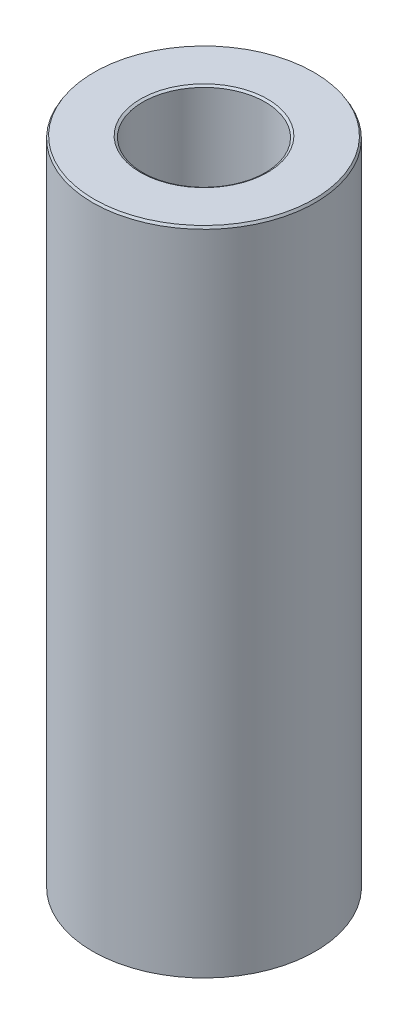
ISO-10303-21;
HEADER;
FILE_DESCRIPTION(('STEP AP214'),'2;1');
FILE_NAME('part.step','',(''),(''),'','','');
FILE_SCHEMA(('AUTOMOTIVE_DESIGN { 1 0 10303 214 1 1 1 1 }'));
ENDSEC;
DATA;
#1=APPLICATION_CONTEXT('core data for automotive mechanical design processes');
#2=APPLICATION_PROTOCOL_DEFINITION('international standard','automotive_design',2000,#1);
#3=PRODUCT_CONTEXT('',#1,'mechanical');
#4=PRODUCT('Part','Part','',(#3));
#5=PRODUCT_RELATED_PRODUCT_CATEGORY('part','',(#4));
#6=PRODUCT_DEFINITION_FORMATION('','',#4);
#7=PRODUCT_DEFINITION_CONTEXT('part definition',#1,'design');
#8=PRODUCT_DEFINITION('design','',#6,#7);
#9=PRODUCT_DEFINITION_SHAPE('','',#8);
#10=(LENGTH_UNIT() NAMED_UNIT(*) SI_UNIT(.MILLI.,.METRE.));
#11=(NAMED_UNIT(*) PLANE_ANGLE_UNIT() SI_UNIT($,.RADIAN.));
#12=(NAMED_UNIT(*) SI_UNIT($,.STERADIAN.) SOLID_ANGLE_UNIT());
#13=UNCERTAINTY_MEASURE_WITH_UNIT(LENGTH_MEASURE(1.E-05),#10,'distance_accuracy_value','');
#14=(GEOMETRIC_REPRESENTATION_CONTEXT(3) GLOBAL_UNCERTAINTY_ASSIGNED_CONTEXT((#13)) GLOBAL_UNIT_ASSIGNED_CONTEXT((#10,
#11,#12)) REPRESENTATION_CONTEXT('',''));
#15=CARTESIAN_POINT('',(0.,0.,0.));
#16=DIRECTION('',(0.,0.,1.));
#17=DIRECTION('',(1.,0.,0.));
#18=AXIS2_PLACEMENT_3D('',#15,#16,#17);
#19=CARTESIAN_POINT('',(0.,175.694921431091,0.));
#20=DIRECTION('',(0.,-1.,0.));
#21=DIRECTION('',(0.,0.,-1.));
#22=AXIS2_PLACEMENT_3D('',#19,#20,#21);
#23=CYLINDRICAL_SURFACE('',#22,30.);
#24=CARTESIAN_POINT('',(0.,0.384070202301856,0.));
#25=DIRECTION('',(0.,1.,0.));
#26=DIRECTION('',(0.,0.,1.));
#27=AXIS2_PLACEMENT_3D('',#24,#25,#26);
#28=CIRCLE('',#27,30.);
#29=CARTESIAN_POINT('',(0.,0.384070202301856,30.));
#30=VERTEX_POINT('',#29);
#31=EDGE_CURVE('E10',#30,#30,#28,.T.);
#32=ORIENTED_EDGE('',*,*,#31,.T.);
#33=EDGE_LOOP('',(#32));
#34=FACE_BOUND('',#33,.T.);
#35=CARTESIAN_POINT('',(0.,175.063537443208,0.));
#36=DIRECTION('',(0.,1.,0.));
#37=DIRECTION('',(0.,0.,1.));
#38=AXIS2_PLACEMENT_3D('',#35,#36,#37);
#39=CIRCLE('',#38,30.);
#40=CARTESIAN_POINT('',(0.,175.063537443208,30.));
#41=VERTEX_POINT('',#40);
#42=EDGE_CURVE('E50',#41,#41,#39,.F.);
#43=ORIENTED_EDGE('',*,*,#42,.T.);
#44=EDGE_LOOP('',(#43));
#45=FACE_BOUND('',#44,.T.);
#46=ADVANCED_FACE('F39',(#34,#45),#23,.T.);
#47=CARTESIAN_POINT('',(0.,175.694921431091,0.));
#48=DIRECTION('',(0.,1.,0.));
#49=DIRECTION('',(0.,0.,1.));
#50=AXIS2_PLACEMENT_3D('',#47,#48,#49);
#51=PLANE('',#50);
#52=CARTESIAN_POINT('',(0.,175.694921431091,0.));
#53=DIRECTION('',(0.,1.,0.));
#54=DIRECTION('',(0.,0.,1.));
#55=AXIS2_PLACEMENT_3D('',#52,#53,#54);
#56=CIRCLE('',#55,17.1297919131304);
#57=CARTESIAN_POINT('',(0.,175.694921431091,17.1297919131304));
#58=VERTEX_POINT('',#57);
#59=EDGE_CURVE('E58',#58,#58,#56,.F.);
#60=ORIENTED_EDGE('',*,*,#59,.T.);
#61=EDGE_LOOP('',(#60));
#62=FACE_BOUND('',#61,.T.);
#63=CARTESIAN_POINT('',(0.,175.694921431091,0.));
#64=DIRECTION('',(0.,1.,0.));
#65=DIRECTION('',(0.,0.,1.));
#66=AXIS2_PLACEMENT_3D('',#63,#64,#65);
#67=CIRCLE('',#66,29.6159297976981);
#68=CARTESIAN_POINT('',(0.,175.694921431091,29.6159297976981));
#69=VERTEX_POINT('',#68);
#70=EDGE_CURVE('E61',#69,#69,#67,.T.);
#71=ORIENTED_EDGE('',*,*,#70,.T.);
#72=EDGE_LOOP('',(#71));
#73=FACE_BOUND('',#72,.T.);
#74=ADVANCED_FACE('F88',(#62,#73),#51,.T.);
#75=CARTESIAN_POINT('',(0.,0.,0.));
#76=DIRECTION('',(0.,1.,0.));
#77=DIRECTION('',(0.,0.,1.));
#78=AXIS2_PLACEMENT_3D('',#75,#76,#77);
#79=PLANE('',#78);
#80=CARTESIAN_POINT('',(0.,0.,0.));
#81=DIRECTION('',(0.,1.,0.));
#82=DIRECTION('',(0.,0.,1.));
#83=AXIS2_PLACEMENT_3D('',#80,#81,#82);
#84=CIRCLE('',#83,16.8824781275501);
#85=CARTESIAN_POINT('',(0.,0.,16.8824781275501));
#86=VERTEX_POINT('',#85);
#87=EDGE_CURVE('E51',#86,#86,#84,.T.);
#88=ORIENTED_EDGE('',*,*,#87,.T.);
#89=EDGE_LOOP('',(#88));
#90=FACE_BOUND('',#89,.T.);
#91=CARTESIAN_POINT('',(0.,0.,0.));
#92=DIRECTION('',(0.,1.,0.));
#93=DIRECTION('',(0.,0.,1.));
#94=AXIS2_PLACEMENT_3D('',#91,#92,#93);
#95=CIRCLE('',#94,29.3686160121178);
#96=CARTESIAN_POINT('',(0.,0.,29.3686160121178));
#97=VERTEX_POINT('',#96);
#98=EDGE_CURVE('E54',#97,#97,#95,.F.);
#99=ORIENTED_EDGE('',*,*,#98,.T.);
#100=EDGE_LOOP('',(#99));
#101=FACE_BOUND('',#100,.T.);
#102=ADVANCED_FACE('F83',(#90,#101),#79,.F.);
#103=CARTESIAN_POINT('',(0.,175.694921431091,0.));
#104=DIRECTION('',(0.,-1.,0.));
#105=DIRECTION('',(0.,0.,-1.));
#106=AXIS2_PLACEMENT_3D('',#103,#104,#105);
#107=CYLINDRICAL_SURFACE('',#106,16.4984079252482);
#108=CARTESIAN_POINT('',(0.,175.310851228789,0.));
#109=DIRECTION('',(0.,1.,0.));
#110=DIRECTION('',(0.,0.,1.));
#111=AXIS2_PLACEMENT_3D('',#108,#109,#110);
#112=CIRCLE('',#111,16.4984079252482);
#113=CARTESIAN_POINT('',(0.,175.310851228789,16.4984079252482));
#114=VERTEX_POINT('',#113);
#115=EDGE_CURVE('E67',#114,#114,#112,.T.);
#116=ORIENTED_EDGE('',*,*,#115,.T.);
#117=EDGE_LOOP('',(#116));
#118=FACE_BOUND('',#117,.T.);
#119=CARTESIAN_POINT('',(0.,0.631383987882234,0.));
#120=DIRECTION('',(0.,1.,0.));
#121=DIRECTION('',(0.,0.,1.));
#122=AXIS2_PLACEMENT_3D('',#119,#120,#121);
#123=CIRCLE('',#122,16.4984079252482);
#124=CARTESIAN_POINT('',(0.,0.631383987882234,16.4984079252482));
#125=VERTEX_POINT('',#124);
#126=EDGE_CURVE('E69',#125,#125,#123,.F.);
#127=ORIENTED_EDGE('',*,*,#126,.T.);
#128=EDGE_LOOP('',(#127));
#129=FACE_BOUND('',#128,.T.);
#130=ADVANCED_FACE('F71',(#118,#129),#107,.F.);
#131=CARTESIAN_POINT('',(0.,175.310851228789,0.));
#132=DIRECTION('',(0.,1.,0.));
#133=DIRECTION('',(0.,0.,1.));
#134=AXIS2_PLACEMENT_3D('',#131,#132,#133);
#135=CONICAL_SURFACE('',#134,16.4984079252482,1.02429700954694);
#136=ORIENTED_EDGE('',*,*,#59,.F.);
#137=EDGE_LOOP('',(#136));
#138=FACE_BOUND('',#137,.T.);
#139=ORIENTED_EDGE('',*,*,#115,.F.);
#140=EDGE_LOOP('',(#139));
#141=FACE_BOUND('',#140,.T.);
#142=ADVANCED_FACE('F77',(#138,#141),#135,.F.);
#143=CARTESIAN_POINT('',(0.,0.,0.));
#144=DIRECTION('',(0.,-1.,0.));
#145=DIRECTION('',(0.,0.,-1.));
#146=AXIS2_PLACEMENT_3D('',#143,#144,#145);
#147=CONICAL_SURFACE('',#146,16.8824781275501,0.546499317247941);
#148=ORIENTED_EDGE('',*,*,#126,.F.);
#149=EDGE_LOOP('',(#148));
#150=FACE_BOUND('',#149,.T.);
#151=ORIENTED_EDGE('',*,*,#87,.F.);
#152=EDGE_LOOP('',(#151));
#153=FACE_BOUND('',#152,.T.);
#154=ADVANCED_FACE('F73',(#150,#153),#147,.F.);
#155=CARTESIAN_POINT('',(0.,0.384070202301856,0.));
#156=DIRECTION('',(0.,1.,0.));
#157=DIRECTION('',(0.,0.,1.));
#158=AXIS2_PLACEMENT_3D('',#155,#156,#157);
#159=CONICAL_SURFACE('',#158,30.,1.02429700954693);
#160=ORIENTED_EDGE('',*,*,#98,.F.);
#161=EDGE_LOOP('',(#160));
#162=FACE_BOUND('',#161,.T.);
#163=ORIENTED_EDGE('',*,*,#31,.F.);
#164=EDGE_LOOP('',(#163));
#165=FACE_BOUND('',#164,.T.);
#166=ADVANCED_FACE('F76',(#162,#165),#159,.T.);
#167=CARTESIAN_POINT('',(0.,175.694921431091,0.));
#168=DIRECTION('',(0.,-1.,0.));
#169=DIRECTION('',(0.,0.,-1.));
#170=AXIS2_PLACEMENT_3D('',#167,#168,#169);
#171=CONICAL_SURFACE('',#170,29.6159297976981,0.546499317247982);
#172=ORIENTED_EDGE('',*,*,#42,.F.);
#173=EDGE_LOOP('',(#172));
#174=FACE_BOUND('',#173,.T.);
#175=ORIENTED_EDGE('',*,*,#70,.F.);
#176=EDGE_LOOP('',(#175));
#177=FACE_BOUND('',#176,.T.);
#178=ADVANCED_FACE('F45',(#174,#177),#171,.T.);
#179=CLOSED_SHELL('',(#46,#74,#102,#130,#142,#154,#166,#178));
#180=MANIFOLD_SOLID_BREP('B2',#179);
#181=ADVANCED_BREP_SHAPE_REPRESENTATION('',(#18,#180),#14);
#182=SHAPE_DEFINITION_REPRESENTATION(#9,#181);
ENDSEC;
END-ISO-10303-21;
